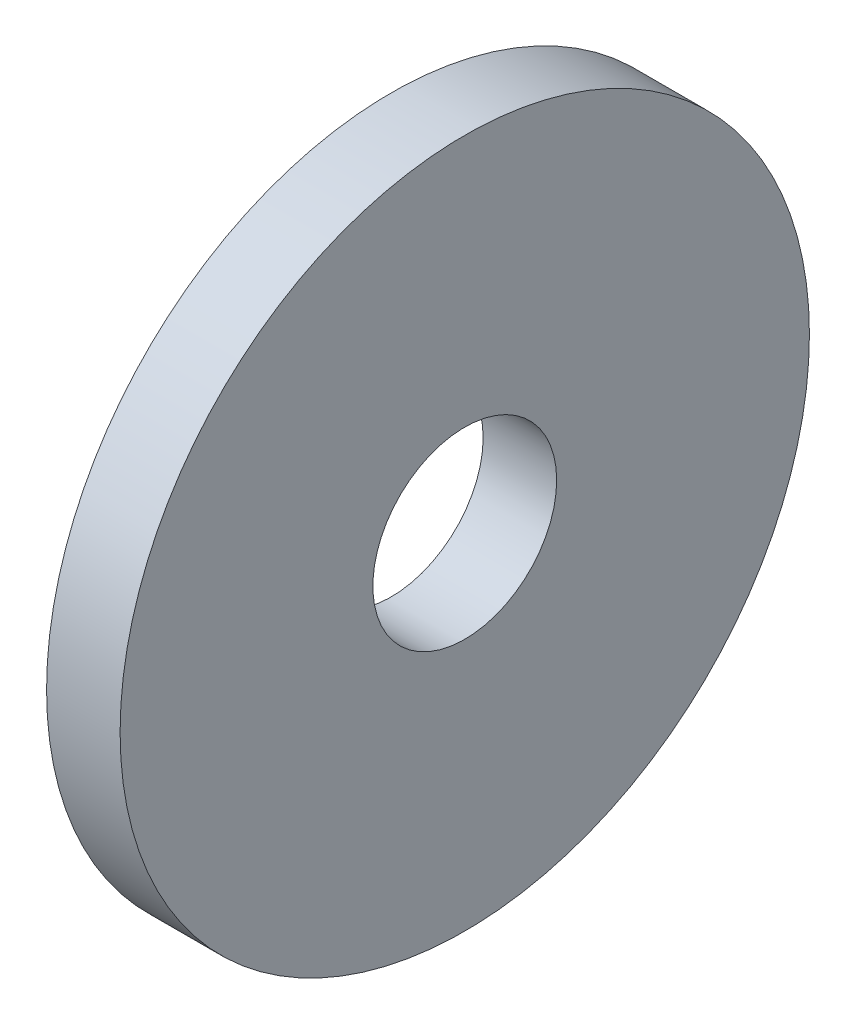
ISO-10303-21;
HEADER;
FILE_DESCRIPTION(('STEP AP214'),'2;1');
FILE_NAME('part.step','',(''),(''),'','','');
FILE_SCHEMA(('AUTOMOTIVE_DESIGN { 1 0 10303 214 1 1 1 1 }'));
ENDSEC;
DATA;
#1=APPLICATION_CONTEXT('core data for automotive mechanical design processes');
#2=APPLICATION_PROTOCOL_DEFINITION('international standard','automotive_design',2000,#1);
#3=PRODUCT_CONTEXT('',#1,'mechanical');
#4=PRODUCT('Part','Part','',(#3));
#5=PRODUCT_RELATED_PRODUCT_CATEGORY('part','',(#4));
#6=PRODUCT_DEFINITION_FORMATION('','',#4);
#7=PRODUCT_DEFINITION_CONTEXT('part definition',#1,'design');
#8=PRODUCT_DEFINITION('design','',#6,#7);
#9=PRODUCT_DEFINITION_SHAPE('','',#8);
#10=(LENGTH_UNIT() NAMED_UNIT(*) SI_UNIT(.MILLI.,.METRE.));
#11=(NAMED_UNIT(*) PLANE_ANGLE_UNIT() SI_UNIT($,.RADIAN.));
#12=(NAMED_UNIT(*) SI_UNIT($,.STERADIAN.) SOLID_ANGLE_UNIT());
#13=UNCERTAINTY_MEASURE_WITH_UNIT(LENGTH_MEASURE(1.E-05),#10,'distance_accuracy_value','');
#14=(GEOMETRIC_REPRESENTATION_CONTEXT(3) GLOBAL_UNCERTAINTY_ASSIGNED_CONTEXT((#13)) GLOBAL_UNIT_ASSIGNED_CONTEXT((#10,
#11,#12)) REPRESENTATION_CONTEXT('',''));
#15=CARTESIAN_POINT('',(0.,0.,0.));
#16=DIRECTION('',(0.,0.,1.));
#17=DIRECTION('',(1.,0.,0.));
#18=AXIS2_PLACEMENT_3D('',#15,#16,#17);
#19=CARTESIAN_POINT('',(8.,0.,0.));
#20=DIRECTION('',(-1.,0.,0.));
#21=DIRECTION('',(0.,0.,1.));
#22=AXIS2_PLACEMENT_3D('',#19,#20,#21);
#23=CYLINDRICAL_SURFACE('',#22,37.5);
#24=CARTESIAN_POINT('',(8.,0.,0.));
#25=DIRECTION('',(1.,0.,0.));
#26=DIRECTION('',(0.,0.,-1.));
#27=AXIS2_PLACEMENT_3D('',#24,#25,#26);
#28=CIRCLE('',#27,37.5);
#29=CARTESIAN_POINT('',(8.,0.,-37.5));
#30=VERTEX_POINT('',#29);
#31=EDGE_CURVE('E10',#30,#30,#28,.T.);
#32=ORIENTED_EDGE('',*,*,#31,.F.);
#33=EDGE_LOOP('',(#32));
#34=FACE_BOUND('',#33,.T.);
#35=CARTESIAN_POINT('',(0.,0.,0.));
#36=DIRECTION('',(1.,0.,0.));
#37=DIRECTION('',(0.,0.,-1.));
#38=AXIS2_PLACEMENT_3D('',#35,#36,#37);
#39=CIRCLE('',#38,37.5);
#40=CARTESIAN_POINT('',(0.,0.,-37.5));
#41=VERTEX_POINT('',#40);
#42=EDGE_CURVE('E43',#41,#41,#39,.T.);
#43=ORIENTED_EDGE('',*,*,#42,.T.);
#44=EDGE_LOOP('',(#43));
#45=FACE_BOUND('',#44,.T.);
#46=ADVANCED_FACE('F40',(#34,#45),#23,.T.);
#47=CARTESIAN_POINT('',(8.,0.,0.));
#48=DIRECTION('',(1.,0.,0.));
#49=DIRECTION('',(0.,0.,-1.));
#50=AXIS2_PLACEMENT_3D('',#47,#48,#49);
#51=PLANE('',#50);
#52=CARTESIAN_POINT('',(8.,0.,0.));
#53=DIRECTION('',(1.,0.,0.));
#54=DIRECTION('',(0.,0.,-1.));
#55=AXIS2_PLACEMENT_3D('',#52,#53,#54);
#56=CIRCLE('',#55,10.);
#57=CARTESIAN_POINT('',(8.,0.,-10.));
#58=VERTEX_POINT('',#57);
#59=EDGE_CURVE('E54',#58,#58,#56,.T.);
#60=ORIENTED_EDGE('',*,*,#59,.F.);
#61=EDGE_LOOP('',(#60));
#62=FACE_BOUND('',#61,.T.);
#63=ORIENTED_EDGE('',*,*,#31,.T.);
#64=EDGE_LOOP('',(#63));
#65=FACE_BOUND('',#64,.T.);
#66=ADVANCED_FACE('F71',(#62,#65),#51,.T.);
#67=CARTESIAN_POINT('',(0.,0.,0.));
#68=DIRECTION('',(1.,0.,0.));
#69=DIRECTION('',(0.,0.,-1.));
#70=AXIS2_PLACEMENT_3D('',#67,#68,#69);
#71=PLANE('',#70);
#72=CARTESIAN_POINT('',(0.,0.,0.));
#73=DIRECTION('',(1.,0.,0.));
#74=DIRECTION('',(0.,0.,-1.));
#75=AXIS2_PLACEMENT_3D('',#72,#73,#74);
#76=CIRCLE('',#75,10.);
#77=CARTESIAN_POINT('',(0.,0.,-10.));
#78=VERTEX_POINT('',#77);
#79=EDGE_CURVE('E52',#78,#78,#76,.T.);
#80=ORIENTED_EDGE('',*,*,#79,.T.);
#81=EDGE_LOOP('',(#80));
#82=FACE_BOUND('',#81,.T.);
#83=ORIENTED_EDGE('',*,*,#42,.F.);
#84=EDGE_LOOP('',(#83));
#85=FACE_BOUND('',#84,.T.);
#86=ADVANCED_FACE('F62',(#82,#85),#71,.F.);
#87=CARTESIAN_POINT('',(0.,0.,0.));
#88=DIRECTION('',(1.,0.,0.));
#89=DIRECTION('',(0.,0.,-1.));
#90=AXIS2_PLACEMENT_3D('',#87,#88,#89);
#91=CYLINDRICAL_SURFACE('',#90,10.);
#92=ORIENTED_EDGE('',*,*,#79,.F.);
#93=EDGE_LOOP('',(#92));
#94=FACE_BOUND('',#93,.T.);
#95=ORIENTED_EDGE('',*,*,#59,.T.);
#96=EDGE_LOOP('',(#95));
#97=FACE_BOUND('',#96,.T.);
#98=ADVANCED_FACE('F65',(#94,#97),#91,.F.);
#99=CLOSED_SHELL('',(#46,#66,#86,#98));
#100=MANIFOLD_SOLID_BREP('B2',#99);
#101=ADVANCED_BREP_SHAPE_REPRESENTATION('',(#18,#100),#14);
#102=SHAPE_DEFINITION_REPRESENTATION(#9,#101);
ENDSEC;
END-ISO-10303-21;
